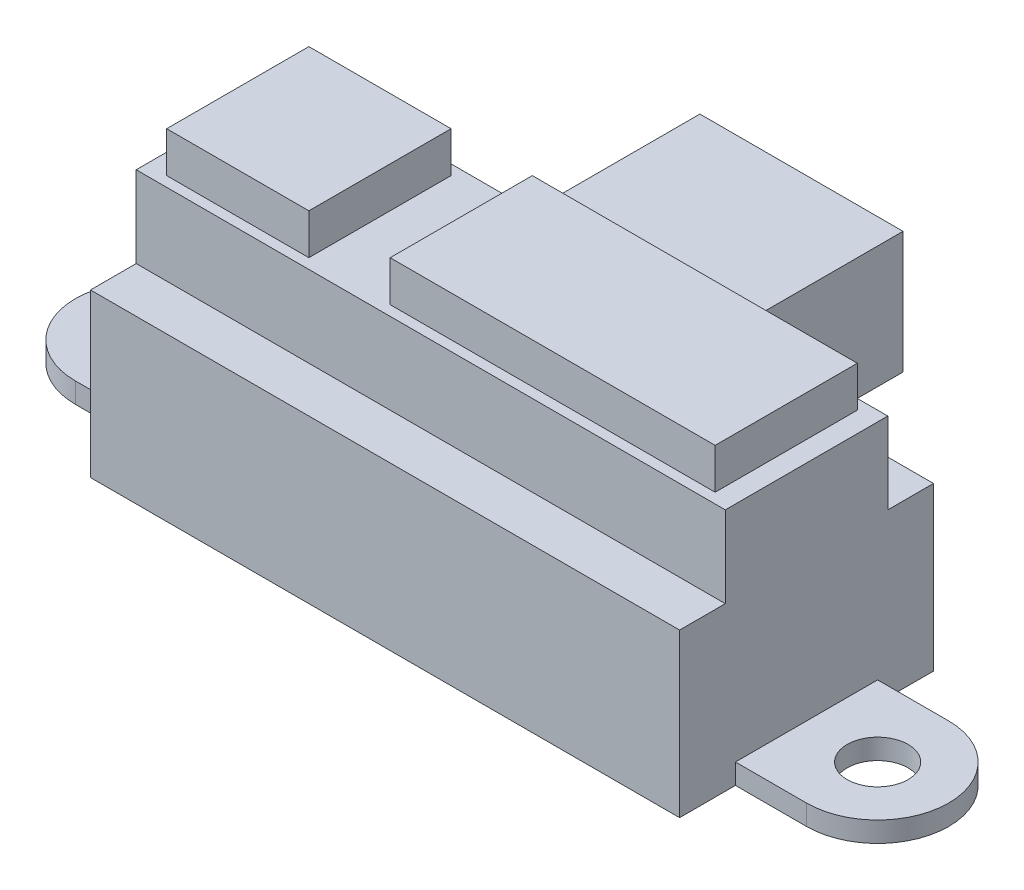
ISO-10303-21;
HEADER;
FILE_DESCRIPTION(('STEP AP214'),'2;1');
FILE_NAME('part.step','',(''),(''),'','','');
FILE_SCHEMA(('AUTOMOTIVE_DESIGN { 1 0 10303 214 1 1 1 1 }'));
ENDSEC;
DATA;
#1=APPLICATION_CONTEXT('core data for automotive mechanical design processes');
#2=APPLICATION_PROTOCOL_DEFINITION('international standard','automotive_design',2000,#1);
#3=PRODUCT_CONTEXT('',#1,'mechanical');
#4=PRODUCT('Part','Part','',(#3));
#5=PRODUCT_RELATED_PRODUCT_CATEGORY('part','',(#4));
#6=PRODUCT_DEFINITION_FORMATION('','',#4);
#7=PRODUCT_DEFINITION_CONTEXT('part definition',#1,'design');
#8=PRODUCT_DEFINITION('design','',#6,#7);
#9=PRODUCT_DEFINITION_SHAPE('','',#8);
#10=(LENGTH_UNIT() NAMED_UNIT(*) SI_UNIT(.MILLI.,.METRE.));
#11=(NAMED_UNIT(*) PLANE_ANGLE_UNIT() SI_UNIT($,.RADIAN.));
#12=(NAMED_UNIT(*) SI_UNIT($,.STERADIAN.) SOLID_ANGLE_UNIT());
#13=UNCERTAINTY_MEASURE_WITH_UNIT(LENGTH_MEASURE(1.E-05),#10,'distance_accuracy_value','');
#14=(GEOMETRIC_REPRESENTATION_CONTEXT(3) GLOBAL_UNCERTAINTY_ASSIGNED_CONTEXT((#13)) GLOBAL_UNIT_ASSIGNED_CONTEXT((#10,
#11,#12)) REPRESENTATION_CONTEXT('',''));
#15=CARTESIAN_POINT('',(0.,0.,0.));
#16=DIRECTION('',(0.,0.,1.));
#17=DIRECTION('',(1.,0.,0.));
#18=AXIS2_PLACEMENT_3D('',#15,#16,#17);
#19=CARTESIAN_POINT('',(-13.5,12.,3.5));
#20=DIRECTION('',(0.,0.,1.));
#21=DIRECTION('',(1.,0.,0.));
#22=AXIS2_PLACEMENT_3D('',#19,#20,#21);
#23=PLANE('',#22);
#24=DIRECTION('',(0.,1.,0.));
#25=VECTOR('',#24,1.);
#26=CARTESIAN_POINT('',(-2.5,3.93774225170145,3.5));
#27=LINE('',#26,#25);
#28=CARTESIAN_POINT('',(-2.5,12.,3.5));
#29=VERTEX_POINT('',#28);
#30=CARTESIAN_POINT('',(-2.5,14.,3.5));
#31=VERTEX_POINT('',#30);
#32=EDGE_CURVE('E226',#29,#31,#27,.T.);
#33=ORIENTED_EDGE('',*,*,#32,.F.);
#34=DIRECTION('',(1.,0.,0.));
#35=VECTOR('',#34,1.);
#36=CARTESIAN_POINT('',(-13.5,12.,3.5));
#37=LINE('',#36,#35);
#38=CARTESIAN_POINT('',(13.5,12.,3.5));
#39=VERTEX_POINT('',#38);
#40=EDGE_CURVE('E238',#29,#39,#37,.T.);
#41=ORIENTED_EDGE('',*,*,#40,.T.);
#42=DIRECTION('',(0.,1.,0.));
#43=VECTOR('',#42,1.);
#44=CARTESIAN_POINT('',(13.5,12.,3.5));
#45=LINE('',#44,#43);
#46=CARTESIAN_POINT('',(13.5,14.,3.5));
#47=VERTEX_POINT('',#46);
#48=EDGE_CURVE('E270',#39,#47,#45,.T.);
#49=ORIENTED_EDGE('',*,*,#48,.T.);
#50=DIRECTION('',(1.,0.,0.));
#51=VECTOR('',#50,1.);
#52=CARTESIAN_POINT('',(-13.5,14.,3.5));
#53=LINE('',#52,#51);
#54=EDGE_CURVE('E240',#31,#47,#53,.T.);
#55=ORIENTED_EDGE('',*,*,#54,.F.);
#56=EDGE_LOOP('',(#33,#41,#49,#55));
#57=FACE_BOUND('',#56,.T.);
#58=ADVANCED_FACE('F33',(#57),#23,.T.);
#59=CARTESIAN_POINT('',(-13.5,12.,-3.5));
#60=DIRECTION('',(0.,0.,-1.));
#61=DIRECTION('',(-1.,0.,0.));
#62=AXIS2_PLACEMENT_3D('',#59,#60,#61);
#63=PLANE('',#62);
#64=DIRECTION('',(0.,1.,0.));
#65=VECTOR('',#64,1.);
#66=CARTESIAN_POINT('',(-2.5,3.93774225170145,-3.5));
#67=LINE('',#66,#65);
#68=CARTESIAN_POINT('',(-2.5,12.,-3.5));
#69=VERTEX_POINT('',#68);
#70=CARTESIAN_POINT('',(-2.5,14.,-3.5));
#71=VERTEX_POINT('',#70);
#72=EDGE_CURVE('E229',#69,#71,#67,.T.);
#73=ORIENTED_EDGE('',*,*,#72,.T.);
#74=DIRECTION('',(-1.,0.,0.));
#75=VECTOR('',#74,1.);
#76=CARTESIAN_POINT('',(-13.5,14.,-3.5));
#77=LINE('',#76,#75);
#78=CARTESIAN_POINT('',(13.5,14.,-3.5));
#79=VERTEX_POINT('',#78);
#80=EDGE_CURVE('E262',#79,#71,#77,.T.);
#81=ORIENTED_EDGE('',*,*,#80,.F.);
#82=DIRECTION('',(0.,1.,0.));
#83=VECTOR('',#82,1.);
#84=CARTESIAN_POINT('',(13.5,12.,-3.5));
#85=LINE('',#84,#83);
#86=CARTESIAN_POINT('',(13.5,12.,-3.5));
#87=VERTEX_POINT('',#86);
#88=EDGE_CURVE('E252',#87,#79,#85,.T.);
#89=ORIENTED_EDGE('',*,*,#88,.F.);
#90=DIRECTION('',(-1.,0.,0.));
#91=VECTOR('',#90,1.);
#92=CARTESIAN_POINT('',(-13.5,12.,-3.5));
#93=LINE('',#92,#91);
#94=EDGE_CURVE('E254',#87,#69,#93,.T.);
#95=ORIENTED_EDGE('',*,*,#94,.T.);
#96=EDGE_LOOP('',(#73,#81,#89,#95));
#97=FACE_BOUND('',#96,.T.);
#98=ADVANCED_FACE('F477',(#97),#63,.T.);
#99=CARTESIAN_POINT('',(0.,14.,0.));
#100=DIRECTION('',(0.,-1.,0.));
#101=DIRECTION('',(0.,0.,-1.));
#102=AXIS2_PLACEMENT_3D('',#99,#100,#101);
#103=PLANE('',#102);
#104=ORIENTED_EDGE('',*,*,#80,.T.);
#105=DIRECTION('',(0.,0.,-1.));
#106=VECTOR('',#105,1.);
#107=CARTESIAN_POINT('',(-2.5,14.,-3.5));
#108=LINE('',#107,#106);
#109=EDGE_CURVE('E241',#31,#71,#108,.T.);
#110=ORIENTED_EDGE('',*,*,#109,.F.);
#111=ORIENTED_EDGE('',*,*,#54,.T.);
#112=DIRECTION('',(0.,0.,-1.));
#113=VECTOR('',#112,1.);
#114=CARTESIAN_POINT('',(13.5,14.,3.5));
#115=LINE('',#114,#113);
#116=EDGE_CURVE('E258',#47,#79,#115,.T.);
#117=ORIENTED_EDGE('',*,*,#116,.T.);
#118=EDGE_LOOP('',(#104,#110,#111,#117));
#119=FACE_BOUND('',#118,.T.);
#120=ADVANCED_FACE('F483',(#119),#103,.F.);
#121=CARTESIAN_POINT('',(-14.5,14.,-6.25));
#122=DIRECTION('',(-1.,0.,0.));
#123=DIRECTION('',(0.,0.,1.));
#124=AXIS2_PLACEMENT_3D('',#121,#122,#123);
#125=PLANE('',#124);
#126=DIRECTION('',(0.,0.,1.));
#127=VECTOR('',#126,1.);
#128=CARTESIAN_POINT('',(-14.5,12.,6.25));
#129=LINE('',#128,#127);
#130=CARTESIAN_POINT('',(-14.5,12.,-4.));
#131=VERTEX_POINT('',#130);
#132=CARTESIAN_POINT('',(-14.5,12.,4.));
#133=VERTEX_POINT('',#132);
#134=EDGE_CURVE('E280',#131,#133,#129,.T.);
#135=ORIENTED_EDGE('',*,*,#134,.F.);
#136=DIRECTION('',(0.,1.,0.));
#137=VECTOR('',#136,1.);
#138=CARTESIAN_POINT('',(-14.5,8.,-4.));
#139=LINE('',#138,#137);
#140=CARTESIAN_POINT('',(-14.5,8.,-4.));
#141=VERTEX_POINT('',#140);
#142=EDGE_CURVE('E298',#141,#131,#139,.T.);
#143=ORIENTED_EDGE('',*,*,#142,.F.);
#144=DIRECTION('',(0.,0.,1.));
#145=VECTOR('',#144,1.);
#146=CARTESIAN_POINT('',(-14.5,8.,0.));
#147=LINE('',#146,#145);
#148=CARTESIAN_POINT('',(-14.5,8.,-6.25));
#149=VERTEX_POINT('',#148);
#150=EDGE_CURVE('E286',#149,#141,#147,.T.);
#151=ORIENTED_EDGE('',*,*,#150,.F.);
#152=DIRECTION('',(0.,-1.,0.));
#153=VECTOR('',#152,1.);
#154=CARTESIAN_POINT('',(-14.5,14.,-6.25));
#155=LINE('',#154,#153);
#156=CARTESIAN_POINT('',(-14.5,0.,-6.25));
#157=VERTEX_POINT('',#156);
#158=EDGE_CURVE('E369',#149,#157,#155,.T.);
#159=ORIENTED_EDGE('',*,*,#158,.T.);
#160=DIRECTION('',(0.,0.,-1.));
#161=VECTOR('',#160,1.);
#162=CARTESIAN_POINT('',(-14.5,0.,-6.25));
#163=LINE('',#162,#161);
#164=CARTESIAN_POINT('',(-14.5,0.,-3.5));
#165=VERTEX_POINT('',#164);
#166=EDGE_CURVE('E355',#165,#157,#163,.T.);
#167=ORIENTED_EDGE('',*,*,#166,.F.);
#168=DIRECTION('',(0.,-1.,0.));
#169=VECTOR('',#168,1.);
#170=CARTESIAN_POINT('',(-14.5,1.,-3.5));
#171=LINE('',#170,#169);
#172=CARTESIAN_POINT('',(-14.5,1.,-3.5));
#173=VERTEX_POINT('',#172);
#174=EDGE_CURVE('E383',#173,#165,#171,.T.);
#175=ORIENTED_EDGE('',*,*,#174,.F.);
#176=DIRECTION('',(0.,0.,-1.));
#177=VECTOR('',#176,1.);
#178=CARTESIAN_POINT('',(-14.5,1.,0.));
#179=LINE('',#178,#177);
#180=CARTESIAN_POINT('',(-14.5,1.,3.5));
#181=VERTEX_POINT('',#180);
#182=EDGE_CURVE('E381',#181,#173,#179,.T.);
#183=ORIENTED_EDGE('',*,*,#182,.F.);
#184=DIRECTION('',(0.,1.,0.));
#185=VECTOR('',#184,1.);
#186=CARTESIAN_POINT('',(-14.5,1.,3.5));
#187=LINE('',#186,#185);
#188=CARTESIAN_POINT('',(-14.5,0.,3.5));
#189=VERTEX_POINT('',#188);
#190=EDGE_CURVE('E41',#189,#181,#187,.T.);
#191=ORIENTED_EDGE('',*,*,#190,.F.);
#192=CARTESIAN_POINT('',(-14.5,0.,6.25));
#193=VERTEX_POINT('',#192);
#194=EDGE_CURVE('E356',#193,#189,#163,.T.);
#195=ORIENTED_EDGE('',*,*,#194,.F.);
#196=DIRECTION('',(0.,-1.,0.));
#197=VECTOR('',#196,1.);
#198=CARTESIAN_POINT('',(-14.5,14.,6.25));
#199=LINE('',#198,#197);
#200=CARTESIAN_POINT('',(-14.5,8.,6.25));
#201=VERTEX_POINT('',#200);
#202=EDGE_CURVE('E370',#201,#193,#199,.T.);
#203=ORIENTED_EDGE('',*,*,#202,.F.);
#204=DIRECTION('',(0.,0.,1.));
#205=VECTOR('',#204,1.);
#206=CARTESIAN_POINT('',(-14.5,8.,0.));
#207=LINE('',#206,#205);
#208=CARTESIAN_POINT('',(-14.5,8.,4.));
#209=VERTEX_POINT('',#208);
#210=EDGE_CURVE('E307',#209,#201,#207,.T.);
#211=ORIENTED_EDGE('',*,*,#210,.F.);
#212=DIRECTION('',(0.,1.,0.));
#213=VECTOR('',#212,1.);
#214=CARTESIAN_POINT('',(-14.5,8.,4.));
#215=LINE('',#214,#213);
#216=EDGE_CURVE('E314',#209,#133,#215,.T.);
#217=ORIENTED_EDGE('',*,*,#216,.T.);
#218=EDGE_LOOP('',(#135,#143,#151,#159,#167,#175,#183,#191,#195,#203,#211,#217));
#219=FACE_BOUND('',#218,.T.);
#220=ADVANCED_FACE('F450',(#219),#125,.T.);
#221=CARTESIAN_POINT('',(14.5,14.,-6.25));
#222=DIRECTION('',(1.,0.,0.));
#223=DIRECTION('',(0.,0.,-1.));
#224=AXIS2_PLACEMENT_3D('',#221,#222,#223);
#225=PLANE('',#224);
#226=DIRECTION('',(0.,0.,-1.));
#227=VECTOR('',#226,1.);
#228=CARTESIAN_POINT('',(14.5,12.,6.25));
#229=LINE('',#228,#227);
#230=CARTESIAN_POINT('',(14.5,12.,4.));
#231=VERTEX_POINT('',#230);
#232=CARTESIAN_POINT('',(14.5,12.,-4.));
#233=VERTEX_POINT('',#232);
#234=EDGE_CURVE('E272',#231,#233,#229,.T.);
#235=ORIENTED_EDGE('',*,*,#234,.F.);
#236=DIRECTION('',(0.,1.,0.));
#237=VECTOR('',#236,1.);
#238=CARTESIAN_POINT('',(14.5,8.,4.));
#239=LINE('',#238,#237);
#240=CARTESIAN_POINT('',(14.5,8.,4.));
#241=VERTEX_POINT('',#240);
#242=EDGE_CURVE('E290',#241,#231,#239,.T.);
#243=ORIENTED_EDGE('',*,*,#242,.F.);
#244=DIRECTION('',(0.,0.,-1.));
#245=VECTOR('',#244,1.);
#246=CARTESIAN_POINT('',(14.5,8.,0.));
#247=LINE('',#246,#245);
#248=CARTESIAN_POINT('',(14.5,8.,6.25));
#249=VERTEX_POINT('',#248);
#250=EDGE_CURVE('E311',#249,#241,#247,.T.);
#251=ORIENTED_EDGE('',*,*,#250,.F.);
#252=DIRECTION('',(0.,-1.,0.));
#253=VECTOR('',#252,1.);
#254=CARTESIAN_POINT('',(14.5,14.,6.25));
#255=LINE('',#254,#253);
#256=CARTESIAN_POINT('',(14.5,0.,6.25));
#257=VERTEX_POINT('',#256);
#258=EDGE_CURVE('E373',#249,#257,#255,.T.);
#259=ORIENTED_EDGE('',*,*,#258,.T.);
#260=DIRECTION('',(0.,0.,1.));
#261=VECTOR('',#260,1.);
#262=CARTESIAN_POINT('',(14.5,0.,-6.25));
#263=LINE('',#262,#261);
#264=CARTESIAN_POINT('',(14.5,0.,3.5));
#265=VERTEX_POINT('',#264);
#266=EDGE_CURVE('E362',#265,#257,#263,.T.);
#267=ORIENTED_EDGE('',*,*,#266,.F.);
#268=DIRECTION('',(0.,-1.,0.));
#269=VECTOR('',#268,1.);
#270=CARTESIAN_POINT('',(14.5,1.,3.5));
#271=LINE('',#270,#269);
#272=CARTESIAN_POINT('',(14.5,1.,3.5));
#273=VERTEX_POINT('',#272);
#274=EDGE_CURVE('E433',#273,#265,#271,.T.);
#275=ORIENTED_EDGE('',*,*,#274,.F.);
#276=DIRECTION('',(0.,0.,1.));
#277=VECTOR('',#276,1.);
#278=CARTESIAN_POINT('',(14.5,1.,0.));
#279=LINE('',#278,#277);
#280=CARTESIAN_POINT('',(14.5,1.,-3.5));
#281=VERTEX_POINT('',#280);
#282=EDGE_CURVE('E372',#281,#273,#279,.T.);
#283=ORIENTED_EDGE('',*,*,#282,.F.);
#284=DIRECTION('',(0.,1.,0.));
#285=VECTOR('',#284,1.);
#286=CARTESIAN_POINT('',(14.5,1.,-3.5));
#287=LINE('',#286,#285);
#288=CARTESIAN_POINT('',(14.5,0.,-3.5));
#289=VERTEX_POINT('',#288);
#290=EDGE_CURVE('E379',#289,#281,#287,.T.);
#291=ORIENTED_EDGE('',*,*,#290,.F.);
#292=CARTESIAN_POINT('',(14.5,0.,-6.25));
#293=VERTEX_POINT('',#292);
#294=EDGE_CURVE('E363',#293,#289,#263,.T.);
#295=ORIENTED_EDGE('',*,*,#294,.F.);
#296=DIRECTION('',(0.,-1.,0.));
#297=VECTOR('',#296,1.);
#298=CARTESIAN_POINT('',(14.5,14.,-6.25));
#299=LINE('',#298,#297);
#300=CARTESIAN_POINT('',(14.5,8.,-6.25));
#301=VERTEX_POINT('',#300);
#302=EDGE_CURVE('E375',#301,#293,#299,.T.);
#303=ORIENTED_EDGE('',*,*,#302,.F.);
#304=DIRECTION('',(0.,0.,-1.));
#305=VECTOR('',#304,1.);
#306=CARTESIAN_POINT('',(14.5,8.,0.));
#307=LINE('',#306,#305);
#308=CARTESIAN_POINT('',(14.5,8.,-4.));
#309=VERTEX_POINT('',#308);
#310=EDGE_CURVE('E293',#309,#301,#307,.T.);
#311=ORIENTED_EDGE('',*,*,#310,.F.);
#312=DIRECTION('',(0.,1.,0.));
#313=VECTOR('',#312,1.);
#314=CARTESIAN_POINT('',(14.5,8.,-4.));
#315=LINE('',#314,#313);
#316=EDGE_CURVE('E300',#309,#233,#315,.T.);
#317=ORIENTED_EDGE('',*,*,#316,.T.);
#318=EDGE_LOOP('',(#235,#243,#251,#259,#267,#275,#283,#291,#295,#303,#311,#317));
#319=FACE_BOUND('',#318,.T.);
#320=ADVANCED_FACE('F542',(#319),#225,.T.);
#321=CARTESIAN_POINT('',(14.5,14.,6.25));
#322=DIRECTION('',(0.,0.,1.));
#323=DIRECTION('',(1.,0.,0.));
#324=AXIS2_PLACEMENT_3D('',#321,#322,#323);
#325=PLANE('',#324);
#326=ORIENTED_EDGE('',*,*,#258,.F.);
#327=DIRECTION('',(1.,0.,0.));
#328=VECTOR('',#327,1.);
#329=CARTESIAN_POINT('',(0.,8.,6.25));
#330=LINE('',#329,#328);
#331=EDGE_CURVE('E309',#201,#249,#330,.T.);
#332=ORIENTED_EDGE('',*,*,#331,.F.);
#333=ORIENTED_EDGE('',*,*,#202,.T.);
#334=DIRECTION('',(-1.,0.,0.));
#335=VECTOR('',#334,1.);
#336=CARTESIAN_POINT('',(14.5,0.,6.25));
#337=LINE('',#336,#335);
#338=EDGE_CURVE('E366',#257,#193,#337,.T.);
#339=ORIENTED_EDGE('',*,*,#338,.F.);
#340=EDGE_LOOP('',(#326,#332,#333,#339));
#341=FACE_BOUND('',#340,.T.);
#342=ADVANCED_FACE('F547',(#341),#325,.T.);
#343=CARTESIAN_POINT('',(14.5,14.,-6.25));
#344=DIRECTION('',(0.,0.,-1.));
#345=DIRECTION('',(-1.,0.,0.));
#346=AXIS2_PLACEMENT_3D('',#343,#344,#345);
#347=PLANE('',#346);
#348=ORIENTED_EDGE('',*,*,#158,.F.);
#349=DIRECTION('',(-1.,0.,0.));
#350=VECTOR('',#349,1.);
#351=CARTESIAN_POINT('',(0.,8.,-6.25));
#352=LINE('',#351,#350);
#353=CARTESIAN_POINT('',(-5.,8.,-6.25));
#354=VERTEX_POINT('',#353);
#355=EDGE_CURVE('E295',#354,#149,#352,.T.);
#356=ORIENTED_EDGE('',*,*,#355,.F.);
#357=DIRECTION('',(0.,1.,0.));
#358=VECTOR('',#357,1.);
#359=CARTESIAN_POINT('',(-5.,4.,-6.25));
#360=LINE('',#359,#358);
#361=CARTESIAN_POINT('',(-5.,4.,-6.25));
#362=VERTEX_POINT('',#361);
#363=EDGE_CURVE('E321',#362,#354,#360,.T.);
#364=ORIENTED_EDGE('',*,*,#363,.F.);
#365=DIRECTION('',(-1.,0.,0.));
#366=VECTOR('',#365,1.);
#367=CARTESIAN_POINT('',(5.,4.,-6.25));
#368=LINE('',#367,#366);
#369=CARTESIAN_POINT('',(5.,4.,-6.25));
#370=VERTEX_POINT('',#369);
#371=EDGE_CURVE('E326',#370,#362,#368,.T.);
#372=ORIENTED_EDGE('',*,*,#371,.F.);
#373=DIRECTION('',(0.,-1.,0.));
#374=VECTOR('',#373,1.);
#375=CARTESIAN_POINT('',(5.,4.,-6.25));
#376=LINE('',#375,#374);
#377=CARTESIAN_POINT('',(5.,8.,-6.25));
#378=VERTEX_POINT('',#377);
#379=EDGE_CURVE('E338',#378,#370,#376,.T.);
#380=ORIENTED_EDGE('',*,*,#379,.F.);
#381=EDGE_CURVE('E296',#301,#378,#352,.T.);
#382=ORIENTED_EDGE('',*,*,#381,.F.);
#383=ORIENTED_EDGE('',*,*,#302,.T.);
#384=DIRECTION('',(1.,0.,0.));
#385=VECTOR('',#384,1.);
#386=CARTESIAN_POINT('',(14.5,0.,-6.25));
#387=LINE('',#386,#385);
#388=EDGE_CURVE('E359',#157,#293,#387,.T.);
#389=ORIENTED_EDGE('',*,*,#388,.F.);
#390=EDGE_LOOP('',(#348,#356,#364,#372,#380,#382,#383,#389));
#391=FACE_BOUND('',#390,.T.);
#392=ADVANCED_FACE('F552',(#391),#347,.T.);
#393=CARTESIAN_POINT('',(18.,1.,0.));
#394=DIRECTION('',(0.,-1.,0.));
#395=DIRECTION('',(0.,0.,-1.));
#396=AXIS2_PLACEMENT_3D('',#393,#394,#395);
#397=PLANE('',#396);
#398=CARTESIAN_POINT('',(-18.,1.,0.));
#399=DIRECTION('',(0.,1.,0.));
#400=DIRECTION('',(0.,0.,1.));
#401=AXIS2_PLACEMENT_3D('',#398,#399,#400);
#402=CIRCLE('',#401,1.5);
#403=CARTESIAN_POINT('',(-18.,1.,1.5));
#404=VERTEX_POINT('',#403);
#405=EDGE_CURVE('E392',#404,#404,#402,.T.);
#406=ORIENTED_EDGE('',*,*,#405,.F.);
#407=EDGE_LOOP('',(#406));
#408=FACE_BOUND('',#407,.T.);
#409=DIRECTION('',(1.,0.,0.));
#410=VECTOR('',#409,1.);
#411=CARTESIAN_POINT('',(-18.,1.,3.5));
#412=LINE('',#411,#410);
#413=CARTESIAN_POINT('',(-18.,1.,3.5));
#414=VERTEX_POINT('',#413);
#415=EDGE_CURVE('E409',#414,#181,#412,.T.);
#416=ORIENTED_EDGE('',*,*,#415,.T.);
#417=ORIENTED_EDGE('',*,*,#182,.T.);
#418=DIRECTION('',(-1.,0.,0.));
#419=VECTOR('',#418,1.);
#420=CARTESIAN_POINT('',(-18.,1.,-3.5));
#421=LINE('',#420,#419);
#422=CARTESIAN_POINT('',(-18.,1.,-3.5));
#423=VERTEX_POINT('',#422);
#424=EDGE_CURVE('E401',#173,#423,#421,.T.);
#425=ORIENTED_EDGE('',*,*,#424,.T.);
#426=CARTESIAN_POINT('',(-18.,1.,0.));
#427=DIRECTION('',(0.,1.,0.));
#428=DIRECTION('',(0.,0.,1.));
#429=AXIS2_PLACEMENT_3D('',#426,#427,#428);
#430=CIRCLE('',#429,3.5);
#431=EDGE_CURVE('E406',#423,#414,#430,.T.);
#432=ORIENTED_EDGE('',*,*,#431,.T.);
#433=EDGE_LOOP('',(#416,#417,#425,#432));
#434=FACE_BOUND('',#433,.T.);
#435=ADVANCED_FACE('F444',(#408,#434),#397,.F.);
#436=CARTESIAN_POINT('',(-18.,1.,-3.5));
#437=DIRECTION('',(0.,0.,1.));
#438=DIRECTION('',(1.,0.,0.));
#439=AXIS2_PLACEMENT_3D('',#436,#437,#438);
#440=PLANE('',#439);
#441=ORIENTED_EDGE('',*,*,#424,.F.);
#442=ORIENTED_EDGE('',*,*,#174,.T.);
#443=DIRECTION('',(-1.,0.,0.));
#444=VECTOR('',#443,1.);
#445=CARTESIAN_POINT('',(-18.,0.,-3.5));
#446=LINE('',#445,#444);
#447=CARTESIAN_POINT('',(-18.,0.,-3.5));
#448=VERTEX_POINT('',#447);
#449=EDGE_CURVE('E415',#165,#448,#446,.T.);
#450=ORIENTED_EDGE('',*,*,#449,.T.);
#451=DIRECTION('',(0.,-1.,0.));
#452=VECTOR('',#451,1.);
#453=CARTESIAN_POINT('',(-18.,1.,-3.5));
#454=LINE('',#453,#452);
#455=EDGE_CURVE('E427',#423,#448,#454,.T.);
#456=ORIENTED_EDGE('',*,*,#455,.F.);
#457=EDGE_LOOP('',(#441,#442,#450,#456));
#458=FACE_BOUND('',#457,.T.);
#459=ADVANCED_FACE('F455',(#458),#440,.F.);
#460=CARTESIAN_POINT('',(-18.,1.,3.5));
#461=DIRECTION('',(0.,0.,-1.));
#462=DIRECTION('',(-1.,0.,0.));
#463=AXIS2_PLACEMENT_3D('',#460,#461,#462);
#464=PLANE('',#463);
#465=DIRECTION('',(1.,0.,0.));
#466=VECTOR('',#465,1.);
#467=CARTESIAN_POINT('',(-18.,0.,3.5));
#468=LINE('',#467,#466);
#469=CARTESIAN_POINT('',(-18.,0.,3.5));
#470=VERTEX_POINT('',#469);
#471=EDGE_CURVE('E402',#470,#189,#468,.T.);
#472=ORIENTED_EDGE('',*,*,#471,.T.);
#473=ORIENTED_EDGE('',*,*,#190,.T.);
#474=ORIENTED_EDGE('',*,*,#415,.F.);
#475=DIRECTION('',(0.,-1.,0.));
#476=VECTOR('',#475,1.);
#477=CARTESIAN_POINT('',(-18.,1.,3.5));
#478=LINE('',#477,#476);
#479=EDGE_CURVE('E424',#414,#470,#478,.T.);
#480=ORIENTED_EDGE('',*,*,#479,.T.);
#481=EDGE_LOOP('',(#472,#473,#474,#480));
#482=FACE_BOUND('',#481,.T.);
#483=ADVANCED_FACE('F438',(#482),#464,.F.);
#484=CARTESIAN_POINT('',(18.,1.,-3.5));
#485=VERTEX_POINT('',#484);
#486=EDGE_CURVE('E403',#485,#281,#421,.T.);
#487=ORIENTED_EDGE('',*,*,#486,.T.);
#488=ORIENTED_EDGE('',*,*,#282,.T.);
#489=CARTESIAN_POINT('',(18.,1.,3.5));
#490=VERTEX_POINT('',#489);
#491=EDGE_CURVE('E408',#273,#490,#412,.T.);
#492=ORIENTED_EDGE('',*,*,#491,.T.);
#493=CARTESIAN_POINT('',(18.,1.,0.));
#494=DIRECTION('',(0.,1.,0.));
#495=DIRECTION('',(0.,0.,-1.));
#496=AXIS2_PLACEMENT_3D('',#493,#494,#495);
#497=CIRCLE('',#496,3.5);
#498=EDGE_CURVE('E398',#490,#485,#497,.T.);
#499=ORIENTED_EDGE('',*,*,#498,.T.);
#500=EDGE_LOOP('',(#487,#488,#492,#499));
#501=FACE_BOUND('',#500,.T.);
#502=CARTESIAN_POINT('',(18.,1.,0.));
#503=DIRECTION('',(0.,1.,0.));
#504=DIRECTION('',(0.,0.,-1.));
#505=AXIS2_PLACEMENT_3D('',#502,#503,#504);
#506=CIRCLE('',#505,1.5);
#507=CARTESIAN_POINT('',(18.,1.,-1.5));
#508=VERTEX_POINT('',#507);
#509=EDGE_CURVE('E386',#508,#508,#506,.T.);
#510=ORIENTED_EDGE('',*,*,#509,.F.);
#511=EDGE_LOOP('',(#510));
#512=FACE_BOUND('',#511,.T.);
#513=ADVANCED_FACE('F561',(#501,#512),#397,.F.);
#514=CARTESIAN_POINT('',(18.,0.,0.));
#515=DIRECTION('',(0.,-1.,0.));
#516=DIRECTION('',(0.,0.,-1.));
#517=AXIS2_PLACEMENT_3D('',#514,#515,#516);
#518=PLANE('',#517);
#519=CARTESIAN_POINT('',(18.,0.,3.5));
#520=VERTEX_POINT('',#519);
#521=EDGE_CURVE('E420',#265,#520,#468,.T.);
#522=ORIENTED_EDGE('',*,*,#521,.F.);
#523=ORIENTED_EDGE('',*,*,#266,.T.);
#524=ORIENTED_EDGE('',*,*,#338,.T.);
#525=ORIENTED_EDGE('',*,*,#194,.T.);
#526=ORIENTED_EDGE('',*,*,#471,.F.);
#527=CARTESIAN_POINT('',(-18.,0.,0.));
#528=DIRECTION('',(0.,1.,0.));
#529=DIRECTION('',(0.,0.,1.));
#530=AXIS2_PLACEMENT_3D('',#527,#528,#529);
#531=CIRCLE('',#530,3.5);
#532=EDGE_CURVE('E418',#448,#470,#531,.T.);
#533=ORIENTED_EDGE('',*,*,#532,.F.);
#534=ORIENTED_EDGE('',*,*,#449,.F.);
#535=ORIENTED_EDGE('',*,*,#166,.T.);
#536=ORIENTED_EDGE('',*,*,#388,.T.);
#537=ORIENTED_EDGE('',*,*,#294,.T.);
#538=CARTESIAN_POINT('',(18.,0.,-3.5));
#539=VERTEX_POINT('',#538);
#540=EDGE_CURVE('E416',#539,#289,#446,.T.);
#541=ORIENTED_EDGE('',*,*,#540,.F.);
#542=CARTESIAN_POINT('',(18.,0.,0.));
#543=DIRECTION('',(0.,1.,0.));
#544=DIRECTION('',(0.,0.,-1.));
#545=AXIS2_PLACEMENT_3D('',#542,#543,#544);
#546=CIRCLE('',#545,3.5);
#547=EDGE_CURVE('E395',#520,#539,#546,.T.);
#548=ORIENTED_EDGE('',*,*,#547,.F.);
#549=EDGE_LOOP('',(#522,#523,#524,#525,#526,#533,#534,#535,#536,#537,#541,#548));
#550=FACE_BOUND('',#549,.T.);
#551=CARTESIAN_POINT('',(18.,0.,0.));
#552=DIRECTION('',(0.,1.,0.));
#553=DIRECTION('',(0.,0.,-1.));
#554=AXIS2_PLACEMENT_3D('',#551,#552,#553);
#555=CIRCLE('',#554,1.5);
#556=CARTESIAN_POINT('',(18.,0.,-1.5));
#557=VERTEX_POINT('',#556);
#558=EDGE_CURVE('E385',#557,#557,#555,.T.);
#559=ORIENTED_EDGE('',*,*,#558,.T.);
#560=EDGE_LOOP('',(#559));
#561=FACE_BOUND('',#560,.T.);
#562=CARTESIAN_POINT('',(-18.,0.,0.));
#563=DIRECTION('',(0.,1.,0.));
#564=DIRECTION('',(0.,0.,1.));
#565=AXIS2_PLACEMENT_3D('',#562,#563,#564);
#566=CIRCLE('',#565,1.5);
#567=CARTESIAN_POINT('',(-18.,0.,1.5));
#568=VERTEX_POINT('',#567);
#569=EDGE_CURVE('E389',#568,#568,#566,.T.);
#570=ORIENTED_EDGE('',*,*,#569,.T.);
#571=EDGE_LOOP('',(#570));
#572=FACE_BOUND('',#571,.T.);
#573=ADVANCED_FACE('F459',(#550,#561,#572),#518,.T.);
#574=CARTESIAN_POINT('',(18.,1.,0.));
#575=DIRECTION('',(0.,-1.,0.));
#576=DIRECTION('',(0.,0.,-1.));
#577=AXIS2_PLACEMENT_3D('',#574,#575,#576);
#578=CYLINDRICAL_SURFACE('',#577,3.5);
#579=ORIENTED_EDGE('',*,*,#547,.T.);
#580=DIRECTION('',(0.,-1.,0.));
#581=VECTOR('',#580,1.);
#582=CARTESIAN_POINT('',(18.,1.,-3.5));
#583=LINE('',#582,#581);
#584=EDGE_CURVE('E430',#485,#539,#583,.T.);
#585=ORIENTED_EDGE('',*,*,#584,.F.);
#586=ORIENTED_EDGE('',*,*,#498,.F.);
#587=DIRECTION('',(0.,-1.,0.));
#588=VECTOR('',#587,1.);
#589=CARTESIAN_POINT('',(18.,1.,3.5));
#590=LINE('',#589,#588);
#591=EDGE_CURVE('E412',#490,#520,#590,.T.);
#592=ORIENTED_EDGE('',*,*,#591,.T.);
#593=EDGE_LOOP('',(#579,#585,#586,#592));
#594=FACE_BOUND('',#593,.T.);
#595=ADVANCED_FACE('F35',(#594),#578,.T.);
#596=ORIENTED_EDGE('',*,*,#540,.T.);
#597=ORIENTED_EDGE('',*,*,#290,.T.);
#598=ORIENTED_EDGE('',*,*,#486,.F.);
#599=ORIENTED_EDGE('',*,*,#584,.T.);
#600=EDGE_LOOP('',(#596,#597,#598,#599));
#601=FACE_BOUND('',#600,.T.);
#602=ADVANCED_FACE('F466',(#601),#440,.F.);
#603=CARTESIAN_POINT('',(-18.,1.,0.));
#604=DIRECTION('',(0.,-1.,0.));
#605=DIRECTION('',(0.,0.,-1.));
#606=AXIS2_PLACEMENT_3D('',#603,#604,#605);
#607=CYLINDRICAL_SURFACE('',#606,3.5);
#608=ORIENTED_EDGE('',*,*,#532,.T.);
#609=ORIENTED_EDGE('',*,*,#479,.F.);
#610=ORIENTED_EDGE('',*,*,#431,.F.);
#611=ORIENTED_EDGE('',*,*,#455,.T.);
#612=EDGE_LOOP('',(#608,#609,#610,#611));
#613=FACE_BOUND('',#612,.T.);
#614=ADVANCED_FACE('F463',(#613),#607,.T.);
#615=ORIENTED_EDGE('',*,*,#491,.F.);
#616=ORIENTED_EDGE('',*,*,#274,.T.);
#617=ORIENTED_EDGE('',*,*,#521,.T.);
#618=ORIENTED_EDGE('',*,*,#591,.F.);
#619=EDGE_LOOP('',(#615,#616,#617,#618));
#620=FACE_BOUND('',#619,.T.);
#621=ADVANCED_FACE('F465',(#620),#464,.F.);
#622=CARTESIAN_POINT('',(-18.,1.,0.));
#623=DIRECTION('',(0.,-1.,0.));
#624=DIRECTION('',(0.,0.,-1.));
#625=AXIS2_PLACEMENT_3D('',#622,#623,#624);
#626=CYLINDRICAL_SURFACE('',#625,1.5);
#627=ORIENTED_EDGE('',*,*,#405,.T.);
#628=EDGE_LOOP('',(#627));
#629=FACE_BOUND('',#628,.T.);
#630=ORIENTED_EDGE('',*,*,#569,.F.);
#631=EDGE_LOOP('',(#630));
#632=FACE_BOUND('',#631,.T.);
#633=ADVANCED_FACE('F472',(#629,#632),#626,.F.);
#634=CARTESIAN_POINT('',(18.,1.,0.));
#635=DIRECTION('',(0.,-1.,0.));
#636=DIRECTION('',(0.,0.,-1.));
#637=AXIS2_PLACEMENT_3D('',#634,#635,#636);
#638=CYLINDRICAL_SURFACE('',#637,1.5);
#639=ORIENTED_EDGE('',*,*,#509,.T.);
#640=EDGE_LOOP('',(#639));
#641=FACE_BOUND('',#640,.T.);
#642=ORIENTED_EDGE('',*,*,#558,.F.);
#643=EDGE_LOOP('',(#642));
#644=FACE_BOUND('',#643,.T.);
#645=ADVANCED_FACE('F553',(#641,#644),#638,.F.);
#646=CARTESIAN_POINT('',(-5.,4.,-14.25));
#647=DIRECTION('',(1.,0.,0.));
#648=DIRECTION('',(0.,1.,0.));
#649=AXIS2_PLACEMENT_3D('',#646,#647,#648);
#650=PLANE('',#649);
#651=ORIENTED_EDGE('',*,*,#363,.T.);
#652=DIRECTION('',(0.,1.,0.));
#653=VECTOR('',#652,1.);
#654=CARTESIAN_POINT('',(-5.,4.,-6.25));
#655=LINE('',#654,#653);
#656=CARTESIAN_POINT('',(-5.,10.,-6.25));
#657=VERTEX_POINT('',#656);
#658=EDGE_CURVE('E303',#354,#657,#655,.T.);
#659=ORIENTED_EDGE('',*,*,#658,.T.);
#660=DIRECTION('',(0.,0.,1.));
#661=VECTOR('',#660,1.);
#662=CARTESIAN_POINT('',(-5.,10.,-14.25));
#663=LINE('',#662,#661);
#664=CARTESIAN_POINT('',(-5.,10.,-14.25));
#665=VERTEX_POINT('',#664);
#666=EDGE_CURVE('E352',#665,#657,#663,.T.);
#667=ORIENTED_EDGE('',*,*,#666,.F.);
#668=DIRECTION('',(0.,1.,0.));
#669=VECTOR('',#668,1.);
#670=CARTESIAN_POINT('',(-5.,4.,-14.25));
#671=LINE('',#670,#669);
#672=CARTESIAN_POINT('',(-5.,4.,-14.25));
#673=VERTEX_POINT('',#672);
#674=EDGE_CURVE('E322',#673,#665,#671,.T.);
#675=ORIENTED_EDGE('',*,*,#674,.F.);
#676=DIRECTION('',(0.,0.,1.));
#677=VECTOR('',#676,1.);
#678=CARTESIAN_POINT('',(-5.,4.,-14.25));
#679=LINE('',#678,#677);
#680=EDGE_CURVE('E332',#673,#362,#679,.T.);
#681=ORIENTED_EDGE('',*,*,#680,.T.);
#682=EDGE_LOOP('',(#651,#659,#667,#675,#681));
#683=FACE_BOUND('',#682,.T.);
#684=ADVANCED_FACE('F556',(#683),#650,.F.);
#685=CARTESIAN_POINT('',(5.,10.,-14.25));
#686=DIRECTION('',(0.,-1.,0.));
#687=DIRECTION('',(0.,0.,-1.));
#688=AXIS2_PLACEMENT_3D('',#685,#686,#687);
#689=PLANE('',#688);
#690=DIRECTION('',(1.,0.,0.));
#691=VECTOR('',#690,1.);
#692=CARTESIAN_POINT('',(5.,10.,-6.25));
#693=LINE('',#692,#691);
#694=CARTESIAN_POINT('',(5.,10.,-6.25));
#695=VERTEX_POINT('',#694);
#696=EDGE_CURVE('E335',#657,#695,#693,.T.);
#697=ORIENTED_EDGE('',*,*,#696,.T.);
#698=DIRECTION('',(0.,0.,1.));
#699=VECTOR('',#698,1.);
#700=CARTESIAN_POINT('',(5.,10.,-14.25));
#701=LINE('',#700,#699);
#702=CARTESIAN_POINT('',(5.,10.,-14.25));
#703=VERTEX_POINT('',#702);
#704=EDGE_CURVE('E349',#703,#695,#701,.T.);
#705=ORIENTED_EDGE('',*,*,#704,.F.);
#706=DIRECTION('',(1.,0.,0.));
#707=VECTOR('',#706,1.);
#708=CARTESIAN_POINT('',(5.,10.,-14.25));
#709=LINE('',#708,#707);
#710=EDGE_CURVE('E325',#665,#703,#709,.T.);
#711=ORIENTED_EDGE('',*,*,#710,.F.);
#712=ORIENTED_EDGE('',*,*,#666,.T.);
#713=EDGE_LOOP('',(#697,#705,#711,#712));
#714=FACE_BOUND('',#713,.T.);
#715=ADVANCED_FACE('F621',(#714),#689,.F.);
#716=CARTESIAN_POINT('',(5.,4.,-14.25));
#717=DIRECTION('',(-1.,0.,0.));
#718=DIRECTION('',(0.,-1.,0.));
#719=AXIS2_PLACEMENT_3D('',#716,#717,#718);
#720=PLANE('',#719);
#721=EDGE_CURVE('E339',#695,#378,#376,.T.);
#722=ORIENTED_EDGE('',*,*,#721,.T.);
#723=ORIENTED_EDGE('',*,*,#379,.T.);
#724=DIRECTION('',(0.,0.,1.));
#725=VECTOR('',#724,1.);
#726=CARTESIAN_POINT('',(5.,4.,-14.25));
#727=LINE('',#726,#725);
#728=CARTESIAN_POINT('',(5.,4.,-14.25));
#729=VERTEX_POINT('',#728);
#730=EDGE_CURVE('E346',#729,#370,#727,.T.);
#731=ORIENTED_EDGE('',*,*,#730,.F.);
#732=DIRECTION('',(0.,-1.,0.));
#733=VECTOR('',#732,1.);
#734=CARTESIAN_POINT('',(5.,4.,-14.25));
#735=LINE('',#734,#733);
#736=EDGE_CURVE('E328',#703,#729,#735,.T.);
#737=ORIENTED_EDGE('',*,*,#736,.F.);
#738=ORIENTED_EDGE('',*,*,#704,.T.);
#739=EDGE_LOOP('',(#722,#723,#731,#737,#738));
#740=FACE_BOUND('',#739,.T.);
#741=ADVANCED_FACE('F632',(#740),#720,.F.);
#742=CARTESIAN_POINT('',(5.,4.,-14.25));
#743=DIRECTION('',(0.,1.,0.));
#744=DIRECTION('',(-1.,0.,0.));
#745=AXIS2_PLACEMENT_3D('',#742,#743,#744);
#746=PLANE('',#745);
#747=ORIENTED_EDGE('',*,*,#371,.T.);
#748=ORIENTED_EDGE('',*,*,#680,.F.);
#749=DIRECTION('',(-1.,0.,0.));
#750=VECTOR('',#749,1.);
#751=CARTESIAN_POINT('',(5.,4.,-14.25));
#752=LINE('',#751,#750);
#753=EDGE_CURVE('E330',#729,#673,#752,.T.);
#754=ORIENTED_EDGE('',*,*,#753,.F.);
#755=ORIENTED_EDGE('',*,*,#730,.T.);
#756=EDGE_LOOP('',(#747,#748,#754,#755));
#757=FACE_BOUND('',#756,.T.);
#758=ADVANCED_FACE('F629',(#757),#746,.F.);
#759=CARTESIAN_POINT('',(0.,0.,-14.25));
#760=DIRECTION('',(0.,0.,1.));
#761=DIRECTION('',(1.,0.,0.));
#762=AXIS2_PLACEMENT_3D('',#759,#760,#761);
#763=PLANE('',#762);
#764=ORIENTED_EDGE('',*,*,#674,.T.);
#765=ORIENTED_EDGE('',*,*,#710,.T.);
#766=ORIENTED_EDGE('',*,*,#736,.T.);
#767=ORIENTED_EDGE('',*,*,#753,.T.);
#768=EDGE_LOOP('',(#764,#765,#766,#767));
#769=FACE_BOUND('',#768,.T.);
#770=ADVANCED_FACE('F625',(#769),#763,.F.);
#771=CARTESIAN_POINT('',(0.,8.,-6.25));
#772=DIRECTION('',(0.,0.,-1.));
#773=DIRECTION('',(-1.,0.,0.));
#774=AXIS2_PLACEMENT_3D('',#771,#772,#773);
#775=PLANE('',#774);
#776=EDGE_CURVE('E299',#378,#354,#352,.T.);
#777=ORIENTED_EDGE('',*,*,#776,.F.);
#778=ORIENTED_EDGE('',*,*,#721,.F.);
#779=ORIENTED_EDGE('',*,*,#696,.F.);
#780=ORIENTED_EDGE('',*,*,#658,.F.);
#781=EDGE_LOOP('',(#777,#778,#779,#780));
#782=FACE_BOUND('',#781,.T.);
#783=ADVANCED_FACE('F616',(#782),#775,.F.);
#784=CARTESIAN_POINT('',(0.,8.,-4.));
#785=DIRECTION('',(0.,0.,1.));
#786=DIRECTION('',(1.,0.,0.));
#787=AXIS2_PLACEMENT_3D('',#784,#785,#786);
#788=PLANE('',#787);
#789=ORIENTED_EDGE('',*,*,#142,.T.);
#790=DIRECTION('',(1.,0.,0.));
#791=VECTOR('',#790,1.);
#792=CARTESIAN_POINT('',(0.,12.,-4.));
#793=LINE('',#792,#791);
#794=EDGE_CURVE('E282',#131,#233,#793,.T.);
#795=ORIENTED_EDGE('',*,*,#794,.T.);
#796=ORIENTED_EDGE('',*,*,#316,.F.);
#797=DIRECTION('',(1.,0.,0.));
#798=VECTOR('',#797,1.);
#799=CARTESIAN_POINT('',(0.,8.,-4.));
#800=LINE('',#799,#798);
#801=EDGE_CURVE('E289',#141,#309,#800,.T.);
#802=ORIENTED_EDGE('',*,*,#801,.F.);
#803=EDGE_LOOP('',(#789,#795,#796,#802));
#804=FACE_BOUND('',#803,.T.);
#805=ADVANCED_FACE('F602',(#804),#788,.F.);
#806=CARTESIAN_POINT('',(0.,8.,0.));
#807=DIRECTION('',(0.,1.,0.));
#808=DIRECTION('',(0.,0.,1.));
#809=AXIS2_PLACEMENT_3D('',#806,#807,#808);
#810=PLANE('',#809);
#811=ORIENTED_EDGE('',*,*,#150,.T.);
#812=ORIENTED_EDGE('',*,*,#801,.T.);
#813=ORIENTED_EDGE('',*,*,#310,.T.);
#814=ORIENTED_EDGE('',*,*,#381,.T.);
#815=ORIENTED_EDGE('',*,*,#776,.T.);
#816=ORIENTED_EDGE('',*,*,#355,.T.);
#817=EDGE_LOOP('',(#811,#812,#813,#814,#815,#816));
#818=FACE_BOUND('',#817,.T.);
#819=ADVANCED_FACE('F604',(#818),#810,.T.);
#820=CARTESIAN_POINT('',(0.,8.,4.));
#821=DIRECTION('',(0.,0.,1.));
#822=DIRECTION('',(1.,0.,0.));
#823=AXIS2_PLACEMENT_3D('',#820,#821,#822);
#824=PLANE('',#823);
#825=DIRECTION('',(1.,0.,0.));
#826=VECTOR('',#825,1.);
#827=CARTESIAN_POINT('',(0.,12.,4.));
#828=LINE('',#827,#826);
#829=EDGE_CURVE('E11',#133,#231,#828,.T.);
#830=ORIENTED_EDGE('',*,*,#829,.F.);
#831=ORIENTED_EDGE('',*,*,#216,.F.);
#832=DIRECTION('',(1.,0.,0.));
#833=VECTOR('',#832,1.);
#834=CARTESIAN_POINT('',(0.,8.,4.));
#835=LINE('',#834,#833);
#836=EDGE_CURVE('E285',#209,#241,#835,.T.);
#837=ORIENTED_EDGE('',*,*,#836,.T.);
#838=ORIENTED_EDGE('',*,*,#242,.T.);
#839=EDGE_LOOP('',(#830,#831,#837,#838));
#840=FACE_BOUND('',#839,.T.);
#841=ADVANCED_FACE('F598',(#840),#824,.T.);
#842=CARTESIAN_POINT('',(0.,8.,0.));
#843=DIRECTION('',(0.,1.,0.));
#844=DIRECTION('',(0.,0.,1.));
#845=AXIS2_PLACEMENT_3D('',#842,#843,#844);
#846=PLANE('',#845);
#847=ORIENTED_EDGE('',*,*,#836,.F.);
#848=ORIENTED_EDGE('',*,*,#210,.T.);
#849=ORIENTED_EDGE('',*,*,#331,.T.);
#850=ORIENTED_EDGE('',*,*,#250,.T.);
#851=EDGE_LOOP('',(#847,#848,#849,#850));
#852=FACE_BOUND('',#851,.T.);
#853=ADVANCED_FACE('F594',(#852),#846,.T.);
#854=CARTESIAN_POINT('',(0.,12.,0.));
#855=DIRECTION('',(0.,-1.,0.));
#856=DIRECTION('',(0.,0.,-1.));
#857=AXIS2_PLACEMENT_3D('',#854,#855,#856);
#858=PLANE('',#857);
#859=ORIENTED_EDGE('',*,*,#40,.F.);
#860=DIRECTION('',(0.,0.,-1.));
#861=VECTOR('',#860,1.);
#862=CARTESIAN_POINT('',(-2.5,12.,-3.5));
#863=LINE('',#862,#861);
#864=EDGE_CURVE('E223',#29,#69,#863,.T.);
#865=ORIENTED_EDGE('',*,*,#864,.T.);
#866=ORIENTED_EDGE('',*,*,#94,.F.);
#867=DIRECTION('',(0.,0.,-1.));
#868=VECTOR('',#867,1.);
#869=CARTESIAN_POINT('',(13.5,12.,3.5));
#870=LINE('',#869,#868);
#871=EDGE_CURVE('E247',#39,#87,#870,.T.);
#872=ORIENTED_EDGE('',*,*,#871,.F.);
#873=EDGE_LOOP('',(#859,#865,#866,#872));
#874=FACE_BOUND('',#873,.T.);
#875=DIRECTION('',(0.,0.,1.));
#876=VECTOR('',#875,1.);
#877=CARTESIAN_POINT('',(-6.5,12.,-3.5));
#878=LINE('',#877,#876);
#879=CARTESIAN_POINT('',(-6.5,12.,-3.5));
#880=VERTEX_POINT('',#879);
#881=CARTESIAN_POINT('',(-6.5,12.,3.5));
#882=VERTEX_POINT('',#881);
#883=EDGE_CURVE('E504',#880,#882,#878,.T.);
#884=ORIENTED_EDGE('',*,*,#883,.T.);
#885=CARTESIAN_POINT('',(-13.5,12.,3.5));
#886=VERTEX_POINT('',#885);
#887=EDGE_CURVE('E248',#886,#882,#37,.T.);
#888=ORIENTED_EDGE('',*,*,#887,.F.);
#889=DIRECTION('',(0.,0.,1.));
#890=VECTOR('',#889,1.);
#891=CARTESIAN_POINT('',(-13.5,12.,3.5));
#892=LINE('',#891,#890);
#893=CARTESIAN_POINT('',(-13.5,12.,-3.5));
#894=VERTEX_POINT('',#893);
#895=EDGE_CURVE('E249',#894,#886,#892,.T.);
#896=ORIENTED_EDGE('',*,*,#895,.F.);
#897=EDGE_CURVE('E511',#880,#894,#93,.T.);
#898=ORIENTED_EDGE('',*,*,#897,.F.);
#899=EDGE_LOOP('',(#884,#888,#896,#898));
#900=FACE_BOUND('',#899,.T.);
#901=ORIENTED_EDGE('',*,*,#134,.T.);
#902=ORIENTED_EDGE('',*,*,#829,.T.);
#903=ORIENTED_EDGE('',*,*,#234,.T.);
#904=ORIENTED_EDGE('',*,*,#794,.F.);
#905=EDGE_LOOP('',(#901,#902,#903,#904));
#906=FACE_BOUND('',#905,.T.);
#907=ADVANCED_FACE('F244',(#874,#900,#906),#858,.F.);
#908=CARTESIAN_POINT('',(13.5,12.,3.5));
#909=DIRECTION('',(1.,0.,0.));
#910=DIRECTION('',(0.,0.,-1.));
#911=AXIS2_PLACEMENT_3D('',#908,#909,#910);
#912=PLANE('',#911);
#913=ORIENTED_EDGE('',*,*,#116,.F.);
#914=ORIENTED_EDGE('',*,*,#48,.F.);
#915=ORIENTED_EDGE('',*,*,#871,.T.);
#916=ORIENTED_EDGE('',*,*,#88,.T.);
#917=EDGE_LOOP('',(#913,#914,#915,#916));
#918=FACE_BOUND('',#917,.T.);
#919=ADVANCED_FACE('F491',(#918),#912,.T.);
#920=DIRECTION('',(0.,1.,0.));
#921=VECTOR('',#920,1.);
#922=CARTESIAN_POINT('',(-6.5,3.93774225170145,3.5));
#923=LINE('',#922,#921);
#924=CARTESIAN_POINT('',(-6.5,14.,3.5));
#925=VERTEX_POINT('',#924);
#926=EDGE_CURVE('E261',#882,#925,#923,.T.);
#927=ORIENTED_EDGE('',*,*,#926,.T.);
#928=CARTESIAN_POINT('',(-13.5,14.,3.5));
#929=VERTEX_POINT('',#928);
#930=EDGE_CURVE('E267',#929,#925,#53,.T.);
#931=ORIENTED_EDGE('',*,*,#930,.F.);
#932=DIRECTION('',(0.,1.,0.));
#933=VECTOR('',#932,1.);
#934=CARTESIAN_POINT('',(-13.5,12.,3.5));
#935=LINE('',#934,#933);
#936=EDGE_CURVE('E273',#886,#929,#935,.T.);
#937=ORIENTED_EDGE('',*,*,#936,.F.);
#938=ORIENTED_EDGE('',*,*,#887,.T.);
#939=EDGE_LOOP('',(#927,#931,#937,#938));
#940=FACE_BOUND('',#939,.T.);
#941=ADVANCED_FACE('F479',(#940),#23,.T.);
#942=CARTESIAN_POINT('',(-13.5,12.,3.5));
#943=DIRECTION('',(-1.,0.,0.));
#944=DIRECTION('',(0.,0.,1.));
#945=AXIS2_PLACEMENT_3D('',#942,#943,#944);
#946=PLANE('',#945);
#947=DIRECTION('',(0.,0.,1.));
#948=VECTOR('',#947,1.);
#949=CARTESIAN_POINT('',(-13.5,14.,3.5));
#950=LINE('',#949,#948);
#951=CARTESIAN_POINT('',(-13.5,14.,-3.5));
#952=VERTEX_POINT('',#951);
#953=EDGE_CURVE('E265',#952,#929,#950,.T.);
#954=ORIENTED_EDGE('',*,*,#953,.F.);
#955=DIRECTION('',(0.,1.,0.));
#956=VECTOR('',#955,1.);
#957=CARTESIAN_POINT('',(-13.5,12.,-3.5));
#958=LINE('',#957,#956);
#959=EDGE_CURVE('E275',#894,#952,#958,.T.);
#960=ORIENTED_EDGE('',*,*,#959,.F.);
#961=ORIENTED_EDGE('',*,*,#895,.T.);
#962=ORIENTED_EDGE('',*,*,#936,.T.);
#963=EDGE_LOOP('',(#954,#960,#961,#962));
#964=FACE_BOUND('',#963,.T.);
#965=ADVANCED_FACE('F490',(#964),#946,.T.);
#966=DIRECTION('',(0.,1.,0.));
#967=VECTOR('',#966,1.);
#968=CARTESIAN_POINT('',(-6.5,3.93774225170145,-3.5));
#969=LINE('',#968,#967);
#970=CARTESIAN_POINT('',(-6.5,14.,-3.5));
#971=VERTEX_POINT('',#970);
#972=EDGE_CURVE('E48',#880,#971,#969,.T.);
#973=ORIENTED_EDGE('',*,*,#972,.F.);
#974=ORIENTED_EDGE('',*,*,#897,.T.);
#975=ORIENTED_EDGE('',*,*,#959,.T.);
#976=EDGE_CURVE('E55',#971,#952,#77,.T.);
#977=ORIENTED_EDGE('',*,*,#976,.F.);
#978=EDGE_LOOP('',(#973,#974,#975,#977));
#979=FACE_BOUND('',#978,.T.);
#980=ADVANCED_FACE('F486',(#979),#63,.T.);
#981=ORIENTED_EDGE('',*,*,#930,.T.);
#982=DIRECTION('',(0.,0.,1.));
#983=VECTOR('',#982,1.);
#984=CARTESIAN_POINT('',(-6.5,14.,-3.5));
#985=LINE('',#984,#983);
#986=EDGE_CURVE('E507',#971,#925,#985,.T.);
#987=ORIENTED_EDGE('',*,*,#986,.F.);
#988=ORIENTED_EDGE('',*,*,#976,.T.);
#989=ORIENTED_EDGE('',*,*,#953,.T.);
#990=EDGE_LOOP('',(#981,#987,#988,#989));
#991=FACE_BOUND('',#990,.T.);
#992=ADVANCED_FACE('F506',(#991),#103,.F.);
#993=CARTESIAN_POINT('',(-2.5,3.93774225170145,-3.5));
#994=DIRECTION('',(1.,0.,0.));
#995=DIRECTION('',(0.,0.,-1.));
#996=AXIS2_PLACEMENT_3D('',#993,#994,#995);
#997=PLANE('',#996);
#998=ORIENTED_EDGE('',*,*,#32,.T.);
#999=ORIENTED_EDGE('',*,*,#109,.T.);
#1000=ORIENTED_EDGE('',*,*,#72,.F.);
#1001=ORIENTED_EDGE('',*,*,#864,.F.);
#1002=EDGE_LOOP('',(#998,#999,#1000,#1001));
#1003=FACE_BOUND('',#1002,.T.);
#1004=ADVANCED_FACE('F225',(#1003),#997,.F.);
#1005=CARTESIAN_POINT('',(-6.5,3.93774225170145,-3.5));
#1006=DIRECTION('',(-1.,0.,0.));
#1007=DIRECTION('',(0.,0.,1.));
#1008=AXIS2_PLACEMENT_3D('',#1005,#1006,#1007);
#1009=PLANE('',#1008);
#1010=ORIENTED_EDGE('',*,*,#972,.T.);
#1011=ORIENTED_EDGE('',*,*,#986,.T.);
#1012=ORIENTED_EDGE('',*,*,#926,.F.);
#1013=ORIENTED_EDGE('',*,*,#883,.F.);
#1014=EDGE_LOOP('',(#1010,#1011,#1012,#1013));
#1015=FACE_BOUND('',#1014,.T.);
#1016=ADVANCED_FACE('F523',(#1015),#1009,.F.);
#1017=CLOSED_SHELL('',(#58,#98,#120,#220,#320,#342,#392,#435,#459,#483,#513,#573,#595,#602,#614,
#621,#633,#645,#684,#715,#741,#758,#770,#783,#805,#819,#841,#853,#907,#919,#941,#965,#980,#992,
#1004,#1016));
#1018=MANIFOLD_SOLID_BREP('B2',#1017);
#1019=ADVANCED_BREP_SHAPE_REPRESENTATION('',(#18,#1018),#14);
#1020=SHAPE_DEFINITION_REPRESENTATION(#9,#1019);
ENDSEC;
END-ISO-10303-21;
